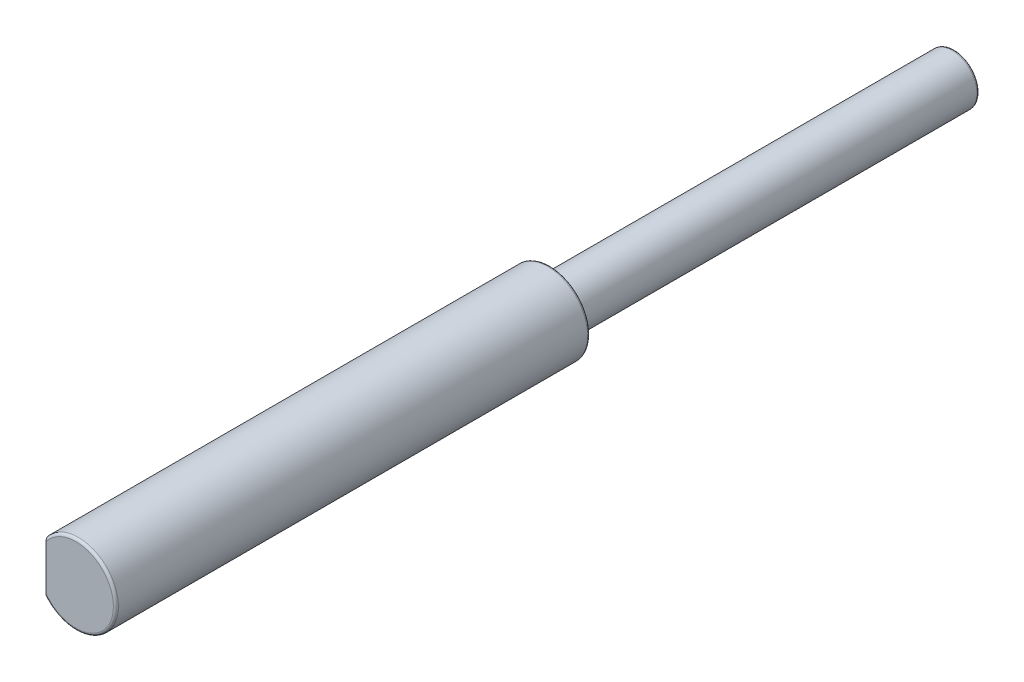
ISO-10303-21;
HEADER;
FILE_DESCRIPTION(('STEP AP214'),'2;1');
FILE_NAME('part.step','',(''),(''),'','','');
FILE_SCHEMA(('AUTOMOTIVE_DESIGN { 1 0 10303 214 1 1 1 1 }'));
ENDSEC;
DATA;
#1=APPLICATION_CONTEXT('core data for automotive mechanical design processes');
#2=APPLICATION_PROTOCOL_DEFINITION('international standard','automotive_design',2000,#1);
#3=PRODUCT_CONTEXT('',#1,'mechanical');
#4=PRODUCT('Part','Part','',(#3));
#5=PRODUCT_RELATED_PRODUCT_CATEGORY('part','',(#4));
#6=PRODUCT_DEFINITION_FORMATION('','',#4);
#7=PRODUCT_DEFINITION_CONTEXT('part definition',#1,'design');
#8=PRODUCT_DEFINITION('design','',#6,#7);
#9=PRODUCT_DEFINITION_SHAPE('','',#8);
#10=(LENGTH_UNIT() NAMED_UNIT(*) SI_UNIT(.MILLI.,.METRE.));
#11=(NAMED_UNIT(*) PLANE_ANGLE_UNIT() SI_UNIT($,.RADIAN.));
#12=(NAMED_UNIT(*) SI_UNIT($,.STERADIAN.) SOLID_ANGLE_UNIT());
#13=UNCERTAINTY_MEASURE_WITH_UNIT(LENGTH_MEASURE(1.E-05),#10,'distance_accuracy_value','');
#14=(GEOMETRIC_REPRESENTATION_CONTEXT(3) GLOBAL_UNCERTAINTY_ASSIGNED_CONTEXT((#13)) GLOBAL_UNIT_ASSIGNED_CONTEXT((#10,
#11,#12)) REPRESENTATION_CONTEXT('',''));
#15=CARTESIAN_POINT('',(0.,0.,0.));
#16=DIRECTION('',(0.,0.,1.));
#17=DIRECTION('',(1.,0.,0.));
#18=AXIS2_PLACEMENT_3D('',#15,#16,#17);
#19=CARTESIAN_POINT('',(0.,0.,88.));
#20=DIRECTION('',(0.,0.,-1.));
#21=DIRECTION('',(-1.,0.,0.));
#22=AXIS2_PLACEMENT_3D('',#19,#20,#21);
#23=CYLINDRICAL_SURFACE('',#22,4.);
#24=CARTESIAN_POINT('',(0.,0.,40.75));
#25=DIRECTION('',(0.,0.,1.));
#26=DIRECTION('',(1.,0.,0.));
#27=AXIS2_PLACEMENT_3D('',#24,#25,#26);
#28=CIRCLE('',#27,4.);
#29=CARTESIAN_POINT('',(4.,0.,40.75));
#30=VERTEX_POINT('',#29);
#31=EDGE_CURVE('E83',#30,#30,#28,.T.);
#32=ORIENTED_EDGE('',*,*,#31,.T.);
#33=EDGE_LOOP('',(#32));
#34=FACE_BOUND('',#33,.T.);
#35=DIRECTION('',(0.,0.,-1.));
#36=VECTOR('',#35,1.);
#37=CARTESIAN_POINT('',(-3.,2.64575131106459,88.));
#38=LINE('',#37,#36);
#39=CARTESIAN_POINT('',(-3.,2.64575131106459,87.75));
#40=VERTEX_POINT('',#39);
#41=CARTESIAN_POINT('',(-3.,2.64575131106459,74.));
#42=VERTEX_POINT('',#41);
#43=EDGE_CURVE('E79',#40,#42,#38,.T.);
#44=ORIENTED_EDGE('',*,*,#43,.F.);
#45=CARTESIAN_POINT('',(0.,0.,87.75));
#46=DIRECTION('',(0.,0.,1.));
#47=DIRECTION('',(1.,0.,0.));
#48=AXIS2_PLACEMENT_3D('',#45,#46,#47);
#49=CIRCLE('',#48,4.);
#50=CARTESIAN_POINT('',(-3.,-2.6457513110822,87.7500000000068));
#51=VERTEX_POINT('',#50);
#52=EDGE_CURVE('E87',#40,#51,#49,.F.);
#53=ORIENTED_EDGE('',*,*,#52,.T.);
#54=DIRECTION('',(0.,0.,-1.));
#55=VECTOR('',#54,1.);
#56=CARTESIAN_POINT('',(-3.,-2.64575131106459,88.));
#57=LINE('',#56,#55);
#58=CARTESIAN_POINT('',(-3.,-2.64575131106459,74.));
#59=VERTEX_POINT('',#58);
#60=EDGE_CURVE('E59',#59,#51,#57,.F.);
#61=ORIENTED_EDGE('',*,*,#60,.F.);
#62=CARTESIAN_POINT('',(-3.,2.64575131106459,74.));
#63=CARTESIAN_POINT('',(-2.99999721865765,2.64575264763035,73.9791771017933));
#64=CARTESIAN_POINT('',(-3.00065104414322,2.64501325874664,73.9583667102621));
#65=CARTESIAN_POINT('',(-3.00323971390562,2.64207438655804,73.9169420901107));
#66=CARTESIAN_POINT('',(-3.00517377049944,2.6398758010454,73.8963277487733));
#67=CARTESIAN_POINT('',(-3.01280599735035,2.63117123632499,73.8353426194659));
#68=CARTESIAN_POINT('',(-3.02033543065855,2.62255555932588,73.7954723155137));
#69=CARTESIAN_POINT('',(-3.03963373462193,2.60016152433259,73.7184409175594));
#70=CARTESIAN_POINT('',(-3.05139419352772,2.5863934077931,73.6812746227141));
#71=CARTESIAN_POINT('',(-3.07830112901551,2.55431036258328,73.6102337240711));
#72=CARTESIAN_POINT('',(-3.09345363670256,2.53598732872243,73.5763651394893));
#73=CARTESIAN_POINT('',(-3.13187000105026,2.48849477917767,73.5013130031303));
#74=CARTESIAN_POINT('',(-3.15612963310801,2.45776344734112,73.4616309088326));
#75=CARTESIAN_POINT('',(-3.20710305301898,2.39087242504345,73.3890245884467));
#76=CARTESIAN_POINT('',(-3.23382106534995,2.35470332008579,73.356112321799));
#77=CARTESIAN_POINT('',(-3.30122670008968,2.25979946283154,73.2821622461198));
#78=CARTESIAN_POINT('',(-3.34245199057519,2.19857897158431,73.2448310839982));
#79=CARTESIAN_POINT('',(-3.42361579489905,2.06994851416959,73.1811894601627));
#80=CARTESIAN_POINT('',(-3.46355153849737,2.00252628388307,73.1549014336163));
#81=CARTESIAN_POINT('',(-3.53484646453599,1.87336733874482,73.1139613798604));
#82=CARTESIAN_POINT('',(-3.56661475029615,1.81219964521164,73.0981819621234));
#83=CARTESIAN_POINT('',(-3.62731627895132,1.68742267036974,73.0714484532797));
#84=CARTESIAN_POINT('',(-3.65624747297848,1.62381167004316,73.0604978297251));
#85=CARTESIAN_POINT('',(-3.7109476554679,1.49459112155725,73.0422520561387));
#86=CARTESIAN_POINT('',(-3.73670982717343,1.42897763139668,73.0349646856023));
#87=CARTESIAN_POINT('',(-3.78479955844081,1.29625567319237,73.0231170022648));
#88=CARTESIAN_POINT('',(-3.8071260739466,1.22914675777103,73.0185575172255));
#89=CARTESIAN_POINT('',(-3.85943462888166,1.0567525442011,73.0093994357966));
#90=CARTESIAN_POINT('',(-3.88693700693209,0.950636920450573,73.0061398286207));
#91=CARTESIAN_POINT('',(-3.93315046452537,0.73644101168407,73.0019687385972));
#92=CARTESIAN_POINT('',(-3.95185752401383,0.628359851681853,73.0010583286396));
#93=CARTESIAN_POINT('',(-3.98034408732636,0.410956076560177,73.0000911568005));
#94=CARTESIAN_POINT('',(-3.99011822231769,0.301632754785654,73.000034907967));
#95=CARTESIAN_POINT('',(-4.00065035065044,0.082577621768194,72.9999863969259));
#96=CARTESIAN_POINT('',(-4.00141028367213,-0.0271540965120481,72.9999941209518));
#97=CARTESIAN_POINT('',(-3.99386984659795,-0.247613686630556,73.0000114460675));
#98=CARTESIAN_POINT('',(-3.98546160868539,-0.358337883798051,73.0000210683898));
#99=CARTESIAN_POINT('',(-3.95946612595734,-0.578744445657669,73.0007373139181));
#100=CARTESIAN_POINT('',(-3.94187557043505,-0.688426420041016,73.0014441886021));
#101=CARTESIAN_POINT('',(-3.89770926519421,-0.905596700125143,73.0049994468546));
#102=CARTESIAN_POINT('',(-3.87116055288902,-1.01309058676677,73.0078414175879));
#103=CARTESIAN_POINT('',(-3.80931776560386,-1.22526882041106,73.0178470845217));
#104=CARTESIAN_POINT('',(-3.77403167407756,-1.32995563602691,73.0250068440294));
#105=CARTESIAN_POINT('',(-3.70032697928781,-1.52208994372308,73.0452962961267));
#106=CARTESIAN_POINT('',(-3.66290834551977,-1.61001224680149,73.0575311845331));
#107=CARTESIAN_POINT('',(-3.58239930613603,-1.78196607247132,73.0903242497436));
#108=CARTESIAN_POINT('',(-3.53929901937067,-1.86599046376544,73.1108970596661));
#109=CARTESIAN_POINT('',(-3.47125539651786,-1.98812044184684,73.1508070404801));
#110=CARTESIAN_POINT('',(-3.44780253562389,-2.02849294321311,73.1657795253937));
#111=CARTESIAN_POINT('',(-3.40018915115656,-2.10732739304201,73.1993269465626));
#112=CARTESIAN_POINT('',(-3.37602837200695,-2.14578863763952,73.2179031978185));
#113=CARTESIAN_POINT('',(-3.32761725160756,-2.22011738485711,73.2591176954024));
#114=CARTESIAN_POINT('',(-3.30336791042226,-2.25599654435261,73.281735838605));
#115=CARTESIAN_POINT('',(-3.25538285493451,-2.32470082681422,73.3316132867519));
#116=CARTESIAN_POINT('',(-3.23164649398324,-2.35752999049744,73.358866311685));
#117=CARTESIAN_POINT('',(-3.18613404355683,-2.41867077723185,73.4177848469809));
#118=CARTESIAN_POINT('',(-3.16432516159463,-2.44706985172823,73.4493327217971));
#119=CARTESIAN_POINT('',(-3.1232074393839,-2.49933629808057,73.5174899411637));
#120=CARTESIAN_POINT('',(-3.10389861565918,-2.52320363998513,73.5540993191642));
#121=CARTESIAN_POINT('',(-3.06895780850736,-2.5655922609406,73.6325455676799));
#122=CARTESIAN_POINT('',(-3.05336811966535,-2.58405254254151,73.6744349849913));
#123=CARTESIAN_POINT('',(-3.02763772145431,-2.61415560244311,73.7621278057368));
#124=CARTESIAN_POINT('',(-3.01748317461369,-2.62581570036592,73.8079209223346));
#125=CARTESIAN_POINT('',(-3.00710313108807,-2.63768026327875,73.8785921473562));
#126=CARTESIAN_POINT('',(-3.00445057098784,-2.64069841459213,73.9026840851055));
#127=CARTESIAN_POINT('',(-3.00089570698436,-2.64473591728022,73.9511771744564));
#128=CARTESIAN_POINT('',(-2.99999449017435,-2.64575402719414,73.9755785086553));
#129=CARTESIAN_POINT('',(-3.,-2.64575131106459,74.));
#130=B_SPLINE_CURVE_WITH_KNOTS('',3,(#62,#63,#64,#65,#66,#67,#68,#69,#70,#71,#72,#73,#74,#75,
#76,#77,#78,#79,#80,#81,#82,#83,#84,#85,#86,#87,#88,#89,#90,#91,#92,#93,#94,#95,#96,#97,#98,#99,
#100,#101,#102,#103,#104,#105,#106,#107,#108,#109,#110,#111,#112,#113,#114,#115,#116,#117,#118,
#119,#120,#121,#122,#123,#124,#125,#126,#127,#128,#129),.UNSPECIFIED.,.F.,.F.,(4,2,2,2,2,2,2,2,
2,2,2,2,2,2,2,2,2,2,2,2,2,2,2,2,2,2,2,2,2,2,2,2,2,4),(0.,0.0624213818929886,0.124804393669022,
0.248514890479589,0.371980784030103,0.495667970086319,0.661980300924786,0.828583959147506,
1.07532693487925,1.32256879582874,1.53439454234984,1.74637215398902,1.95879805156583,
2.17128837596732,2.49984523338534,2.82855211782833,3.15745643078083,3.48628996866265,
3.81903454636186,4.15189917887301,4.48376801806339,4.81533473627189,5.10389463563045,
5.39296316813104,5.53992129300828,5.68693314355223,5.83323318261978,5.97933654982483,
6.12203495676129,6.26473430679557,6.40898639615411,6.55286946204053,6.62601280639637,
6.69920153778217),.UNSPECIFIED.);
#131=EDGE_CURVE('E11',#42,#59,#130,.T.);
#132=ORIENTED_EDGE('',*,*,#131,.F.);
#133=EDGE_LOOP('',(#44,#53,#61,#132));
#134=FACE_BOUND('',#133,.T.);
#135=ADVANCED_FACE('F33',(#34,#134),#23,.T.);
#136=CARTESIAN_POINT('',(0.,0.,88.));
#137=DIRECTION('',(0.,0.,1.));
#138=DIRECTION('',(1.,0.,0.));
#139=AXIS2_PLACEMENT_3D('',#136,#137,#138);
#140=PLANE('',#139);
#141=CARTESIAN_POINT('',(0.,0.,88.));
#142=DIRECTION('',(0.,0.,1.));
#143=DIRECTION('',(1.,0.,0.));
#144=AXIS2_PLACEMENT_3D('',#141,#142,#143);
#145=CIRCLE('',#144,3.75);
#146=CARTESIAN_POINT('',(-3.,-2.25,88.));
#147=VERTEX_POINT('',#146);
#148=CARTESIAN_POINT('',(-3.,2.25,88.));
#149=VERTEX_POINT('',#148);
#150=EDGE_CURVE('E78',#147,#149,#145,.T.);
#151=ORIENTED_EDGE('',*,*,#150,.T.);
#152=DIRECTION('',(0.,-1.,0.));
#153=VECTOR('',#152,1.);
#154=CARTESIAN_POINT('',(-3.,3.,88.));
#155=LINE('',#154,#153);
#156=EDGE_CURVE('E53',#149,#147,#155,.T.);
#157=ORIENTED_EDGE('',*,*,#156,.T.);
#158=EDGE_LOOP('',(#151,#157));
#159=FACE_BOUND('',#158,.T.);
#160=ADVANCED_FACE('F77',(#159),#140,.T.);
#161=CARTESIAN_POINT('',(0.,0.,87.75));
#162=DIRECTION('',(0.,0.,1.));
#163=DIRECTION('',(1.,0.,0.));
#164=AXIS2_PLACEMENT_3D('',#161,#162,#163);
#165=TOROIDAL_SURFACE('',#164,3.75,0.25);
#166=ORIENTED_EDGE('',*,*,#150,.F.);
#167=CARTESIAN_POINT('',(-3.,-2.64403443439112,87.773799386496));
#168=CARTESIAN_POINT('',(-3.,-2.64548008209283,87.7637991792489));
#169=CARTESIAN_POINT('',(-3.,-2.64601894439264,87.7536628933207));
#170=CARTESIAN_POINT('',(-3.,-2.64523302235052,87.7334621879102));
#171=CARTESIAN_POINT('',(-3.,-2.64390762437684,87.7233977931873));
#172=CARTESIAN_POINT('',(-3.,-2.63951461745774,87.7037061693858));
#173=CARTESIAN_POINT('',(-3.,-2.63645413590112,87.6940773247937));
#174=CARTESIAN_POINT('',(-3.,-2.62881935178046,87.6754444862192));
#175=CARTESIAN_POINT('',(-3.,-2.62424407722402,87.6664408979424));
#176=CARTESIAN_POINT('',(-3.,-2.61217205629197,87.6464275375019));
#177=CARTESIAN_POINT('',(-3.,-2.60420895259584,87.6356999728884));
#178=CARTESIAN_POINT('',(-3.,-2.58666453164141,87.615667009744));
#179=CARTESIAN_POINT('',(-3.,-2.57708021676428,87.6063643076297));
#180=CARTESIAN_POINT('',(-3.,-2.55218057990881,87.5852791740603));
#181=CARTESIAN_POINT('',(-3.,-2.53622368259635,87.5742576326543));
#182=CARTESIAN_POINT('',(-3.,-2.50280775035838,87.5548276994062));
#183=CARTESIAN_POINT('',(-3.,-2.48534597811795,87.546424203473));
#184=CARTESIAN_POINT('',(-3.,-2.44000991696766,87.528070288353));
#185=CARTESIAN_POINT('',(-3.,-2.41151600262544,87.5196550801432));
#186=CARTESIAN_POINT('',(-3.,-2.35357638959478,87.5073132836025));
#187=CARTESIAN_POINT('',(-3.,-2.32412862183646,87.5033972331905));
#188=CARTESIAN_POINT('',(-3.,-2.25506625849842,87.4988535697874));
#189=CARTESIAN_POINT('',(-3.,-2.21535002713904,87.4997667379759));
#190=CARTESIAN_POINT('',(-3.,-2.13660249477216,87.5080171263185));
#191=CARTESIAN_POINT('',(-3.,-2.09757091022819,87.5153516198859));
#192=CARTESIAN_POINT('',(-3.,-2.03569507596192,87.5327337685852));
#193=CARTESIAN_POINT('',(-3.,-2.01226663775108,87.5407343046806));
#194=CARTESIAN_POINT('',(-3.,-1.96664210255546,87.559697889111));
#195=CARTESIAN_POINT('',(-3.,-1.94444342864988,87.5706544364845));
#196=CARTESIAN_POINT('',(-3.,-1.91066325463894,87.5910607654904));
#197=CARTESIAN_POINT('',(-3.,-1.8983875800463,87.5993592839936));
#198=CARTESIAN_POINT('',(-3.,-1.87499756335767,87.6174801089334));
#199=CARTESIAN_POINT('',(-3.,-1.86388192061472,87.627300677428));
#200=CARTESIAN_POINT('',(-3.,-1.84655907541748,87.6454746157798));
#201=CARTESIAN_POINT('',(-3.,-1.83988267837084,87.6533769811538));
#202=CARTESIAN_POINT('',(-3.,-1.82778772407117,87.6700978890006));
#203=CARTESIAN_POINT('',(-3.,-1.82236695991515,87.6789147839788));
#204=CARTESIAN_POINT('',(-3.,-1.81431926074574,87.6952526881523));
#205=CARTESIAN_POINT('',(-3.,-1.81133557553406,87.7025961759204));
#206=CARTESIAN_POINT('',(-3.,-1.80662039162596,87.7176759504796));
#207=CARTESIAN_POINT('',(-3.,-1.80488751132736,87.7254117937426));
#208=CARTESIAN_POINT('',(-3.,-1.80284057935687,87.7411184716819));
#209=CARTESIAN_POINT('',(-3.,-1.80253463142567,87.7490903903957));
#210=CARTESIAN_POINT('',(-3.,-1.80339965150944,87.7649540928953));
#211=CARTESIAN_POINT('',(-3.,-1.80457103480006,87.7728458535201));
#212=CARTESIAN_POINT('',(-3.,-1.8081170507688,87.7876974712592));
#213=CARTESIAN_POINT('',(-3.,-1.8103910965022,87.7946820876466));
#214=CARTESIAN_POINT('',(-3.,-1.81590948223129,87.8082517674827));
#215=CARTESIAN_POINT('',(-3.,-1.81915419560708,87.8148366760039));
#216=CARTESIAN_POINT('',(-3.,-1.82870277876567,87.8315275116382));
#217=CARTESIAN_POINT('',(-3.,-1.83565153696064,87.8412636510756));
#218=CARTESIAN_POINT('',(-3.,-1.85096656633345,87.8595505233537));
#219=CARTESIAN_POINT('',(-3.,-1.85933725226782,87.868097408728));
#220=CARTESIAN_POINT('',(-3.,-1.88325213702849,87.8897428591338));
#221=CARTESIAN_POINT('',(-3.,-1.89970832425128,87.9018268624866));
#222=CARTESIAN_POINT('',(-3.,-1.93417412158841,87.9234837178142));
#223=CARTESIAN_POINT('',(-3.,-1.95218737002523,87.9330504648916));
#224=CARTESIAN_POINT('',(-3.,-2.00235055966851,87.9561539181798));
#225=CARTESIAN_POINT('',(-3.,-2.03543392326733,87.9676672670818));
#226=CARTESIAN_POINT('',(-3.,-2.10296154344467,87.9855282687586));
#227=CARTESIAN_POINT('',(-3.,-2.13740838531296,87.9918655617449));
#228=CARTESIAN_POINT('',(-3.,-2.20846582258766,87.9997012414702));
#229=CARTESIAN_POINT('',(-3.,-2.24510294776018,88.0009630196141));
#230=CARTESIAN_POINT('',(-3.,-2.31807622984912,87.9975850196351));
#231=CARTESIAN_POINT('',(-3.,-2.3544129226621,87.9929606330341));
#232=CARTESIAN_POINT('',(-3.,-2.41115313243635,87.9800698367586));
#233=CARTESIAN_POINT('',(-3.,-2.43206597181787,87.9740279019501));
#234=CARTESIAN_POINT('',(-3.,-2.47288418766015,87.9591323519446));
#235=CARTESIAN_POINT('',(-3.,-2.49279059213843,87.9502816758552));
#236=CARTESIAN_POINT('',(-3.,-2.52604176181616,87.9319844157199));
#237=CARTESIAN_POINT('',(-3.,-2.53977599934465,87.9232499437601));
#238=CARTESIAN_POINT('',(-3.,-2.56575479232987,87.9037746825587));
#239=CARTESIAN_POINT('',(-3.,-2.57800163792791,87.8930370439517));
#240=CARTESIAN_POINT('',(-3.,-2.59717379597998,87.8727286708829));
#241=CARTESIAN_POINT('',(-3.,-2.60463210860648,87.8636630644112));
#242=CARTESIAN_POINT('',(-3.,-2.61801586467654,87.8444631313873));
#243=CARTESIAN_POINT('',(-3.,-2.62394402680158,87.834330745972));
#244=CARTESIAN_POINT('',(-3.,-2.63260667329637,87.8158386275426));
#245=CARTESIAN_POINT('',(-3.,-2.63576972988,87.8076794545269));
#246=CARTESIAN_POINT('',(-3.,-2.64085891973676,87.7909804843886));
#247=CARTESIAN_POINT('',(-3.,-2.64278522494664,87.7824407403508));
#248=CARTESIAN_POINT('',(-3.,-2.64403443439112,87.773799386496));
#249=B_SPLINE_CURVE_WITH_KNOTS('',3,(#167,#168,#169,#170,#171,#172,#173,#174,#175,#176,#177,
#178,#179,#180,#181,#182,#183,#184,#185,#186,#187,#188,#189,#190,#191,#192,#193,#194,#195,#196,
#197,#198,#199,#200,#201,#202,#203,#204,#205,#206,#207,#208,#209,#210,#211,#212,#213,#214,#215,
#216,#217,#218,#219,#220,#221,#222,#223,#224,#225,#226,#227,#228,#229,#230,#231,#232,#233,#234,
#235,#236,#237,#238,#239,#240,#241,#242,#243,#244,#245,#246,#247,#248),.UNSPECIFIED.,.T.,.F.,(4,
2,2,2,2,2,2,2,2,2,2,2,2,2,2,2,2,2,2,2,2,2,2,2,2,2,2,2,2,2,2,2,2,2,2,2,2,2,2,2,4),(0.,
0.0302770466454885,0.060564061483908,0.0907275553201078,0.12091044170289,0.160769657337179,
0.20070339479022,0.258559590351555,0.316523340028394,0.405164831391367,0.49401351813019,
0.612621643950337,0.73117943147344,0.805303019231138,0.879264902249387,0.923632640498191,
0.967950086012357,0.998899326319282,1.02979375028502,1.05348096808857,1.07714198148445,
1.10093720664921,1.1247391221081,1.14669124237503,1.16865181769598,1.20432932962018,
1.24011970723737,1.30102484280685,1.36207635291662,1.46659757025698,1.57132747591433,
1.68088672288392,1.79016007494501,1.85531182229234,1.92039561746825,1.96907971280427,
2.01768787236181,2.05278620564993,2.0878217422173,2.11398830591143,2.14015123106635),.UNSPECIFIED.);
#250=EDGE_CURVE('E46',#147,#51,#249,.T.);
#251=ORIENTED_EDGE('',*,*,#250,.T.);
#252=ORIENTED_EDGE('',*,*,#52,.F.);
#253=CARTESIAN_POINT('',(-3.,1.80743517594842,87.7845742979698));
#254=CARTESIAN_POINT('',(-3.,1.8052328147078,87.7764304105719));
#255=CARTESIAN_POINT('',(-3.,1.8037698321215,87.7680771640308));
#256=CARTESIAN_POINT('',(-3.,1.80250656920737,87.7512459962469));
#257=CARTESIAN_POINT('',(-3.,1.8027058553477,87.7427681080874));
#258=CARTESIAN_POINT('',(-3.,1.80473549982463,87.7260424827373));
#259=CARTESIAN_POINT('',(-3.,1.8065607389094,87.7177941069251));
#260=CARTESIAN_POINT('',(-3.,1.81162567003212,87.7017447503993));
#261=CARTESIAN_POINT('',(-3.,1.81486735779015,87.6939444185712));
#262=CARTESIAN_POINT('',(-3.,1.82368735748316,87.6765508009437));
#263=CARTESIAN_POINT('',(-3.,1.82968038884576,87.6671703776163));
#264=CARTESIAN_POINT('',(-3.,1.84304864485747,87.6494615679348));
#265=CARTESIAN_POINT('',(-3.,1.85042667649137,87.641135376613));
#266=CARTESIAN_POINT('',(-3.,1.87139525768374,87.6202119162724));
#267=CARTESIAN_POINT('',(-3.,1.88584209112498,87.6084795891017));
#268=CARTESIAN_POINT('',(-3.,1.91627507351344,87.5872413141373));
#269=CARTESIAN_POINT('',(-3.,1.93226534464622,87.5777415749796));
#270=CARTESIAN_POINT('',(-3.,1.97759936721129,87.5541551976278));
#271=CARTESIAN_POINT('',(-3.,2.0079424371903,87.5419912941246));
#272=CARTESIAN_POINT('',(-3.,2.07007871075845,87.52233239442));
#273=CARTESIAN_POINT('',(-3.,2.10187434053954,87.5148455408175));
#274=CARTESIAN_POINT('',(-3.,2.16814276511171,87.5039172355315));
#275=CARTESIAN_POINT('',(-3.,2.20266089792902,87.5007489886682));
#276=CARTESIAN_POINT('',(-3.,2.27177317278933,87.4994855109975));
#277=CARTESIAN_POINT('',(-3.,2.30636715397177,87.5013835776993));
#278=CARTESIAN_POINT('',(-3.,2.36553623116395,87.5095984959369));
#279=CARTESIAN_POINT('',(-3.,2.39029624868738,87.514584990618));
#280=CARTESIAN_POINT('',(-3.,2.4388707843941,87.528036956941));
#281=CARTESIAN_POINT('',(-3.,2.46268651138729,87.5364978121978));
#282=CARTESIAN_POINT('',(-3.,2.50141883617806,87.5542595679249));
#283=CARTESIAN_POINT('',(-3.,2.51681923693484,87.5625013358062));
#284=CARTESIAN_POINT('',(-3.,2.54623832184497,87.5811812565674));
#285=CARTESIAN_POINT('',(-3.,2.56025911427145,87.5916159792333));
#286=CARTESIAN_POINT('',(-3.,2.58257772955931,87.6116561156901));
#287=CARTESIAN_POINT('',(-3.,2.59138525372785,87.6206911840553));
#288=CARTESIAN_POINT('',(-3.,2.6074798164773,87.6400336128528));
#289=CARTESIAN_POINT('',(-3.,2.61476896887076,87.6503391722895));
#290=CARTESIAN_POINT('',(-3.,2.62614352509558,87.6700413596759));
#291=CARTESIAN_POINT('',(-3.,2.63057471146804,87.6792371929841));
#292=CARTESIAN_POINT('',(-3.,2.63785229687975,87.6982395898317));
#293=CARTESIAN_POINT('',(-3.,2.64069978907657,87.7080457268926));
#294=CARTESIAN_POINT('',(-3.,2.64460489805234,87.7280684051263));
#295=CARTESIAN_POINT('',(-3.,2.64565289315023,87.7382868552978));
#296=CARTESIAN_POINT('',(-3.,2.64583636952696,87.7587405055992));
#297=CARTESIAN_POINT('',(-3.,2.64497213274498,87.7689757030377));
#298=CARTESIAN_POINT('',(-3.,2.64156090521181,87.7882615668717));
#299=CARTESIAN_POINT('',(-3.,2.63916236386081,87.7973392186638));
#300=CARTESIAN_POINT('',(-3.,2.63298994606412,87.8150100846805));
#301=CARTESIAN_POINT('',(-3.,2.62921558553374,87.8236031271639));
#302=CARTESIAN_POINT('',(-3.,2.61898170641749,87.8430407759271));
#303=CARTESIAN_POINT('',(-3.,2.61204494062023,87.8536339467651));
#304=CARTESIAN_POINT('',(-3.,2.59654842716068,87.8735559974321));
#305=CARTESIAN_POINT('',(-3.,2.58798553211628,87.8828823642953));
#306=CARTESIAN_POINT('',(-3.,2.5657942711839,87.9039364210792));
#307=CARTESIAN_POINT('',(-3.,2.55155347456095,87.915015875761));
#308=CARTESIAN_POINT('',(-3.,2.52153089849011,87.9348143576657));
#309=CARTESIAN_POINT('',(-3.,2.50574631182965,87.943528971895));
#310=CARTESIAN_POINT('',(-3.,2.46460548284584,87.9629082726534));
#311=CARTESIAN_POINT('',(-3.,2.43859334436246,87.9721757114716));
#312=CARTESIAN_POINT('',(-3.,2.38546867320279,87.9866022245613));
#313=CARTESIAN_POINT('',(-3.,2.35835398260679,87.991752790042));
#314=CARTESIAN_POINT('',(-3.,2.29265432131112,87.9998412480159));
#315=CARTESIAN_POINT('',(-3.,2.2538558413905,88.001047663091));
#316=CARTESIAN_POINT('',(-3.,2.17654746849227,87.9972229294555));
#317=CARTESIAN_POINT('',(-3.,2.1380379733217,87.9921843654119));
#318=CARTESIAN_POINT('',(-3.,2.07139433844722,87.9778232009146));
#319=CARTESIAN_POINT('',(-3.,2.04297409586416,87.9698071999043));
#320=CARTESIAN_POINT('',(-3.,1.98760592668677,87.949806739353));
#321=CARTESIAN_POINT('',(-3.,1.96065265967884,87.9378379775829));
#322=CARTESIAN_POINT('',(-3.,1.92289426469591,87.9165797599398));
#323=CARTESIAN_POINT('',(-3.,1.91102663741324,87.9091713822135));
#324=CARTESIAN_POINT('',(-3.,1.8881708768165,87.8930596324687));
#325=CARTESIAN_POINT('',(-3.,1.87718327040843,87.8843554934069));
#326=CARTESIAN_POINT('',(-3.,1.8580529516504,87.8668317673652));
#327=CARTESIAN_POINT('',(-3.,1.84972881940413,87.8582125033524));
#328=CARTESIAN_POINT('',(-3.,1.83454218453354,87.8397769118146));
#329=CARTESIAN_POINT('',(-3.,1.82767446778697,87.829965059473));
#330=CARTESIAN_POINT('',(-3.,1.81878761910451,87.8140406457383));
#331=CARTESIAN_POINT('',(-3.,1.81600548574606,87.8083525674496));
#332=CARTESIAN_POINT('',(-3.,1.81115510332697,87.7966737696716));
#333=CARTESIAN_POINT('',(-3.,1.8090871406089,87.7906829298927));
#334=CARTESIAN_POINT('',(-3.,1.80743517594842,87.7845742979698));
#335=B_SPLINE_CURVE_WITH_KNOTS('',3,(#253,#254,#255,#256,#257,#258,#259,#260,#261,#262,#263,
#264,#265,#266,#267,#268,#269,#270,#271,#272,#273,#274,#275,#276,#277,#278,#279,#280,#281,#282,
#283,#284,#285,#286,#287,#288,#289,#290,#291,#292,#293,#294,#295,#296,#297,#298,#299,#300,#301,
#302,#303,#304,#305,#306,#307,#308,#309,#310,#311,#312,#313,#314,#315,#316,#317,#318,#319,#320,
#321,#322,#323,#324,#325,#326,#327,#328,#329,#330,#331,#332,#333,#334),.UNSPECIFIED.,.T.,.F.,(4,
2,2,2,2,2,2,2,2,2,2,2,2,2,2,2,2,2,2,2,2,2,2,2,2,2,2,2,2,2,2,2,2,2,2,2,2,2,2,2,4),(0.,
0.0252816712353772,0.0505567490320386,0.0757525293524596,0.10098392458113,0.134192669770901,
0.167469460460007,0.22298813269124,0.278659417460868,0.376195177090427,0.473900273652466,
0.577537325528572,0.681037338514633,0.756612961301867,0.832088489971702,0.884345405020352,
0.936521180356237,0.974250398590144,1.01192673549705,1.04242629510072,1.07290477592795,
1.10354571963208,1.134182145941,1.16222835654044,1.19028444479466,1.22806122730018,
1.26591188625996,1.31974048246748,1.37366884725145,1.45605197937112,1.53860494456709,
1.65446918104408,1.77047112744703,1.85883693860919,1.94685595605413,1.98876461313397,
2.03069817799091,2.0665421925756,2.10225563051537,2.1212115163839,2.14017499370469),.UNSPECIFIED.);
#336=EDGE_CURVE('E74',#40,#149,#335,.T.);
#337=ORIENTED_EDGE('',*,*,#336,.T.);
#338=EDGE_LOOP('',(#166,#251,#252,#337));
#339=FACE_BOUND('',#338,.T.);
#340=ADVANCED_FACE('F82',(#339),#165,.T.);
#341=CARTESIAN_POINT('',(0.,0.,40.5));
#342=DIRECTION('',(0.,0.,-1.));
#343=DIRECTION('',(-1.,0.,0.));
#344=AXIS2_PLACEMENT_3D('',#341,#342,#343);
#345=CYLINDRICAL_SURFACE('',#344,2.5);
#346=CARTESIAN_POINT('',(0.,0.,0.25));
#347=DIRECTION('',(0.,0.,1.));
#348=DIRECTION('',(1.,0.,0.));
#349=AXIS2_PLACEMENT_3D('',#346,#347,#348);
#350=CIRCLE('',#349,2.5);
#351=CARTESIAN_POINT('',(2.5,0.,0.25));
#352=VERTEX_POINT('',#351);
#353=EDGE_CURVE('E97',#352,#352,#350,.T.);
#354=ORIENTED_EDGE('',*,*,#353,.T.);
#355=EDGE_LOOP('',(#354));
#356=FACE_BOUND('',#355,.T.);
#357=CARTESIAN_POINT('',(0.,0.,40.5));
#358=DIRECTION('',(0.,0.,1.));
#359=DIRECTION('',(1.,0.,0.));
#360=AXIS2_PLACEMENT_3D('',#357,#358,#359);
#361=CIRCLE('',#360,2.5);
#362=CARTESIAN_POINT('',(2.5,0.,40.5));
#363=VERTEX_POINT('',#362);
#364=EDGE_CURVE('E84',#363,#363,#361,.T.);
#365=ORIENTED_EDGE('',*,*,#364,.F.);
#366=EDGE_LOOP('',(#365));
#367=FACE_BOUND('',#366,.T.);
#368=ADVANCED_FACE('F129',(#356,#367),#345,.T.);
#369=CARTESIAN_POINT('',(0.,0.,0.));
#370=DIRECTION('',(0.,0.,1.));
#371=DIRECTION('',(1.,0.,0.));
#372=AXIS2_PLACEMENT_3D('',#369,#370,#371);
#373=PLANE('',#372);
#374=CARTESIAN_POINT('',(0.,0.,0.));
#375=DIRECTION('',(0.,0.,1.));
#376=DIRECTION('',(1.,0.,0.));
#377=AXIS2_PLACEMENT_3D('',#374,#375,#376);
#378=CIRCLE('',#377,2.25);
#379=CARTESIAN_POINT('',(2.25,0.,0.));
#380=VERTEX_POINT('',#379);
#381=EDGE_CURVE('E100',#380,#380,#378,.F.);
#382=ORIENTED_EDGE('',*,*,#381,.T.);
#383=EDGE_LOOP('',(#382));
#384=FACE_BOUND('',#383,.T.);
#385=ADVANCED_FACE('F122',(#384),#373,.F.);
#386=CARTESIAN_POINT('',(0.,0.,40.5));
#387=DIRECTION('',(0.,0.,1.));
#388=DIRECTION('',(1.,0.,0.));
#389=AXIS2_PLACEMENT_3D('',#386,#387,#388);
#390=PLANE('',#389);
#391=CARTESIAN_POINT('',(0.,0.,40.5));
#392=DIRECTION('',(0.,0.,1.));
#393=DIRECTION('',(1.,0.,0.));
#394=AXIS2_PLACEMENT_3D('',#391,#392,#393);
#395=CIRCLE('',#394,3.75);
#396=CARTESIAN_POINT('',(3.75,0.,40.5));
#397=VERTEX_POINT('',#396);
#398=EDGE_CURVE('E94',#397,#397,#395,.F.);
#399=ORIENTED_EDGE('',*,*,#398,.T.);
#400=EDGE_LOOP('',(#399));
#401=FACE_BOUND('',#400,.T.);
#402=ORIENTED_EDGE('',*,*,#364,.T.);
#403=EDGE_LOOP('',(#402));
#404=FACE_BOUND('',#403,.T.);
#405=ADVANCED_FACE('F119',(#401,#404),#390,.F.);
#406=CARTESIAN_POINT('',(0.,0.,40.75));
#407=DIRECTION('',(0.,0.,1.));
#408=DIRECTION('',(1.,0.,0.));
#409=AXIS2_PLACEMENT_3D('',#406,#407,#408);
#410=TOROIDAL_SURFACE('',#409,3.75,0.25);
#411=ORIENTED_EDGE('',*,*,#398,.F.);
#412=EDGE_LOOP('',(#411));
#413=FACE_BOUND('',#412,.T.);
#414=ORIENTED_EDGE('',*,*,#31,.F.);
#415=EDGE_LOOP('',(#414));
#416=FACE_BOUND('',#415,.T.);
#417=ADVANCED_FACE('F121',(#413,#416),#410,.T.);
#418=CARTESIAN_POINT('',(0.,0.,0.25));
#419=DIRECTION('',(0.,0.,1.));
#420=DIRECTION('',(1.,0.,0.));
#421=AXIS2_PLACEMENT_3D('',#418,#419,#420);
#422=TOROIDAL_SURFACE('',#421,2.25,0.25);
#423=ORIENTED_EDGE('',*,*,#381,.F.);
#424=EDGE_LOOP('',(#423));
#425=FACE_BOUND('',#424,.T.);
#426=ORIENTED_EDGE('',*,*,#353,.F.);
#427=EDGE_LOOP('',(#426));
#428=FACE_BOUND('',#427,.T.);
#429=ADVANCED_FACE('F35',(#425,#428),#422,.T.);
#430=CARTESIAN_POINT('',(-4.,3.,74.));
#431=DIRECTION('',(0.,-1.,0.));
#432=DIRECTION('',(0.,0.,-1.));
#433=AXIS2_PLACEMENT_3D('',#430,#431,#432);
#434=CYLINDRICAL_SURFACE('',#433,1.);
#435=DIRECTION('',(0.,-1.,0.));
#436=VECTOR('',#435,1.);
#437=CARTESIAN_POINT('',(-3.,3.,74.));
#438=LINE('',#437,#436);
#439=EDGE_CURVE('E80',#42,#59,#438,.T.);
#440=ORIENTED_EDGE('',*,*,#439,.F.);
#441=ORIENTED_EDGE('',*,*,#131,.T.);
#442=EDGE_LOOP('',(#440,#441));
#443=FACE_BOUND('',#442,.T.);
#444=ADVANCED_FACE('F114',(#443),#434,.F.);
#445=CARTESIAN_POINT('',(-3.,3.,74.));
#446=DIRECTION('',(-1.,0.,0.));
#447=DIRECTION('',(0.,0.,1.));
#448=AXIS2_PLACEMENT_3D('',#445,#446,#447);
#449=PLANE('',#448);
#450=ORIENTED_EDGE('',*,*,#60,.T.);
#451=ORIENTED_EDGE('',*,*,#250,.F.);
#452=ORIENTED_EDGE('',*,*,#156,.F.);
#453=ORIENTED_EDGE('',*,*,#336,.F.);
#454=ORIENTED_EDGE('',*,*,#43,.T.);
#455=ORIENTED_EDGE('',*,*,#439,.T.);
#456=EDGE_LOOP('',(#450,#451,#452,#453,#454,#455));
#457=FACE_BOUND('',#456,.T.);
#458=ADVANCED_FACE('F69',(#457),#449,.T.);
#459=CLOSED_SHELL('',(#135,#160,#340,#368,#385,#405,#417,#429,#444,#458));
#460=MANIFOLD_SOLID_BREP('B2',#459);
#461=ADVANCED_BREP_SHAPE_REPRESENTATION('',(#18,#460),#14);
#462=SHAPE_DEFINITION_REPRESENTATION(#9,#461);
ENDSEC;
END-ISO-10303-21;
